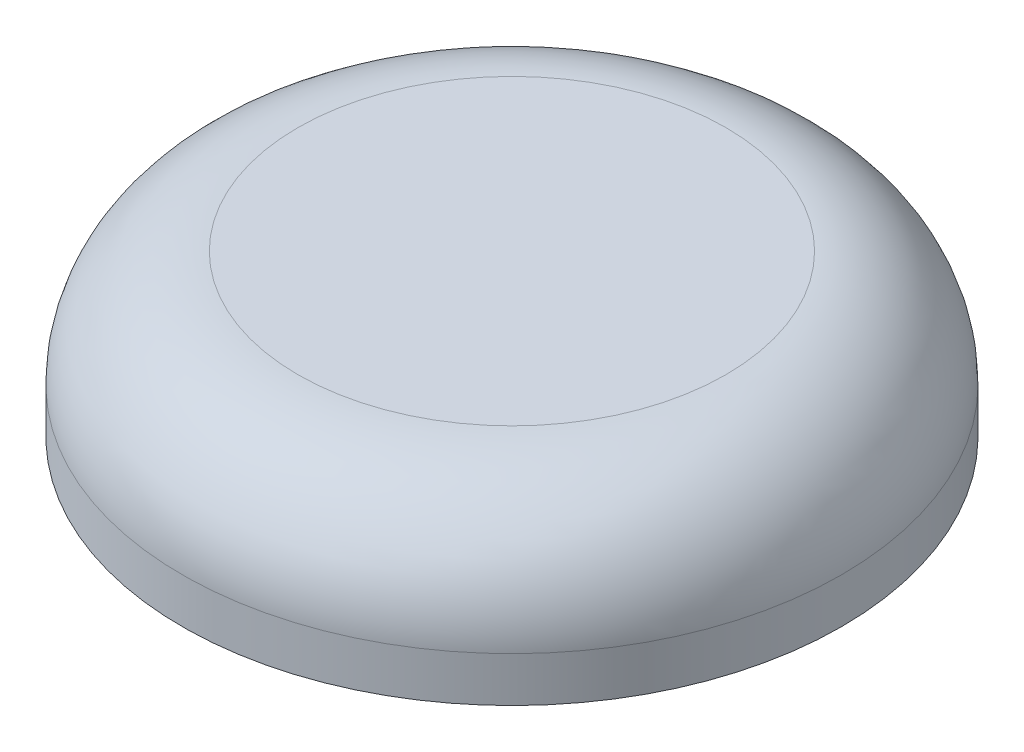
ISO-10303-21;
HEADER;
FILE_DESCRIPTION(('STEP AP214'),'2;1');
FILE_NAME('part.step','',(''),(''),'','','');
FILE_SCHEMA(('AUTOMOTIVE_DESIGN { 1 0 10303 214 1 1 1 1 }'));
ENDSEC;
DATA;
#1=APPLICATION_CONTEXT('core data for automotive mechanical design processes');
#2=APPLICATION_PROTOCOL_DEFINITION('international standard','automotive_design',2000,#1);
#3=PRODUCT_CONTEXT('',#1,'mechanical');
#4=PRODUCT('Part','Part','',(#3));
#5=PRODUCT_RELATED_PRODUCT_CATEGORY('part','',(#4));
#6=PRODUCT_DEFINITION_FORMATION('','',#4);
#7=PRODUCT_DEFINITION_CONTEXT('part definition',#1,'design');
#8=PRODUCT_DEFINITION('design','',#6,#7);
#9=PRODUCT_DEFINITION_SHAPE('','',#8);
#10=(LENGTH_UNIT() NAMED_UNIT(*) SI_UNIT(.MILLI.,.METRE.));
#11=(NAMED_UNIT(*) PLANE_ANGLE_UNIT() SI_UNIT($,.RADIAN.));
#12=(NAMED_UNIT(*) SI_UNIT($,.STERADIAN.) SOLID_ANGLE_UNIT());
#13=UNCERTAINTY_MEASURE_WITH_UNIT(LENGTH_MEASURE(1.E-05),#10,'distance_accuracy_value','');
#14=(GEOMETRIC_REPRESENTATION_CONTEXT(3) GLOBAL_UNCERTAINTY_ASSIGNED_CONTEXT((#13)) GLOBAL_UNIT_ASSIGNED_CONTEXT((#10,
#11,#12)) REPRESENTATION_CONTEXT('',''));
#15=CARTESIAN_POINT('',(0.,0.,0.));
#16=DIRECTION('',(0.,0.,1.));
#17=DIRECTION('',(1.,0.,0.));
#18=AXIS2_PLACEMENT_3D('',#15,#16,#17);
#19=CARTESIAN_POINT('',(0.,1.143,0.));
#20=DIRECTION('',(0.,-1.,0.));
#21=DIRECTION('',(1.,0.,0.));
#22=AXIS2_PLACEMENT_3D('',#19,#20,#21);
#23=PLANE('',#22);
#24=CARTESIAN_POINT('',(0.,1.143,0.));
#25=DIRECTION('',(0.,-1.,0.));
#26=DIRECTION('',(1.,0.,0.));
#27=AXIS2_PLACEMENT_3D('',#24,#25,#26);
#28=CIRCLE('',#27,12.7);
#29=CARTESIAN_POINT('',(12.7,1.143,0.));
#30=VERTEX_POINT('',#29);
#31=EDGE_CURVE('E54',#30,#30,#28,.T.);
#32=ORIENTED_EDGE('',*,*,#31,.F.);
#33=EDGE_LOOP('',(#32));
#34=FACE_BOUND('',#33,.T.);
#35=ADVANCED_FACE('F35',(#34),#23,.F.);
#36=CARTESIAN_POINT('',(0.,0.,0.));
#37=DIRECTION('',(0.,1.,0.));
#38=DIRECTION('',(-1.,0.,0.));
#39=AXIS2_PLACEMENT_3D('',#36,#37,#38);
#40=PLANE('',#39);
#41=CARTESIAN_POINT('',(0.,0.,0.));
#42=DIRECTION('',(0.,-1.,0.));
#43=DIRECTION('',(1.,0.,0.));
#44=AXIS2_PLACEMENT_3D('',#41,#42,#43);
#45=CIRCLE('',#44,12.065);
#46=CARTESIAN_POINT('',(12.065,0.,0.));
#47=VERTEX_POINT('',#46);
#48=EDGE_CURVE('E10',#47,#47,#45,.T.);
#49=ORIENTED_EDGE('',*,*,#48,.T.);
#50=EDGE_LOOP('',(#49));
#51=FACE_BOUND('',#50,.T.);
#52=ADVANCED_FACE('F61',(#51),#40,.F.);
#53=CARTESIAN_POINT('',(0.,0.,0.));
#54=DIRECTION('',(0.,-1.,0.));
#55=DIRECTION('',(1.,0.,0.));
#56=AXIS2_PLACEMENT_3D('',#53,#54,#55);
#57=CYLINDRICAL_SURFACE('',#56,12.065);
#58=ORIENTED_EDGE('',*,*,#48,.F.);
#59=EDGE_LOOP('',(#58));
#60=FACE_BOUND('',#59,.T.);
#61=CARTESIAN_POINT('',(0.,-8.382,0.));
#62=DIRECTION('',(0.,-1.,0.));
#63=DIRECTION('',(1.,0.,0.));
#64=AXIS2_PLACEMENT_3D('',#61,#62,#63);
#65=CIRCLE('',#64,12.065);
#66=CARTESIAN_POINT('',(12.065,-8.382,0.));
#67=VERTEX_POINT('',#66);
#68=EDGE_CURVE('E41',#67,#67,#65,.T.);
#69=ORIENTED_EDGE('',*,*,#68,.T.);
#70=EDGE_LOOP('',(#69));
#71=FACE_BOUND('',#70,.T.);
#72=ADVANCED_FACE('F65',(#60,#71),#57,.F.);
#73=CARTESIAN_POINT('',(-12.065,-8.382,0.));
#74=DIRECTION('',(0.,1.,0.));
#75=DIRECTION('',(-1.,0.,0.));
#76=AXIS2_PLACEMENT_3D('',#73,#74,#75);
#77=PLANE('',#76);
#78=ORIENTED_EDGE('',*,*,#68,.F.);
#79=EDGE_LOOP('',(#78));
#80=FACE_BOUND('',#79,.T.);
#81=CARTESIAN_POINT('',(0.,-8.382,0.));
#82=DIRECTION('',(0.,-1.,0.));
#83=DIRECTION('',(1.,0.,0.));
#84=AXIS2_PLACEMENT_3D('',#81,#82,#83);
#85=CIRCLE('',#84,19.558);
#86=CARTESIAN_POINT('',(19.558,-8.382,0.));
#87=VERTEX_POINT('',#86);
#88=EDGE_CURVE('E45',#87,#87,#85,.T.);
#89=ORIENTED_EDGE('',*,*,#88,.T.);
#90=EDGE_LOOP('',(#89));
#91=FACE_BOUND('',#90,.T.);
#92=ADVANCED_FACE('F69',(#80,#91),#77,.F.);
#93=CARTESIAN_POINT('',(0.,0.,0.));
#94=DIRECTION('',(0.,-1.,0.));
#95=DIRECTION('',(1.,0.,0.));
#96=AXIS2_PLACEMENT_3D('',#93,#94,#95);
#97=CYLINDRICAL_SURFACE('',#96,19.558);
#98=ORIENTED_EDGE('',*,*,#88,.F.);
#99=EDGE_LOOP('',(#98));
#100=FACE_BOUND('',#99,.T.);
#101=CARTESIAN_POINT('',(0.,-5.715,0.));
#102=DIRECTION('',(0.,-1.,0.));
#103=DIRECTION('',(1.,0.,0.));
#104=AXIS2_PLACEMENT_3D('',#101,#102,#103);
#105=CIRCLE('',#104,19.558);
#106=CARTESIAN_POINT('',(19.558,-5.715,0.));
#107=VERTEX_POINT('',#106);
#108=EDGE_CURVE('E49',#107,#107,#105,.T.);
#109=ORIENTED_EDGE('',*,*,#108,.T.);
#110=EDGE_LOOP('',(#109));
#111=FACE_BOUND('',#110,.T.);
#112=ADVANCED_FACE('F75',(#100,#111),#97,.T.);
#113=CARTESIAN_POINT('',(0.,-5.715,0.));
#114=DIRECTION('',(0.,-1.,0.));
#115=DIRECTION('',(1.,0.,0.));
#116=AXIS2_PLACEMENT_3D('',#113,#114,#115);
#117=TOROIDAL_SURFACE('',#116,12.7,6.858);
#118=ORIENTED_EDGE('',*,*,#108,.F.);
#119=EDGE_LOOP('',(#118));
#120=FACE_BOUND('',#119,.T.);
#121=ORIENTED_EDGE('',*,*,#31,.T.);
#122=EDGE_LOOP('',(#121));
#123=FACE_BOUND('',#122,.T.);
#124=ADVANCED_FACE('F58',(#120,#123),#117,.T.);
#125=CLOSED_SHELL('',(#35,#52,#72,#92,#112,#124));
#126=MANIFOLD_SOLID_BREP('B2',#125);
#127=ADVANCED_BREP_SHAPE_REPRESENTATION('',(#18,#126),#14);
#128=SHAPE_DEFINITION_REPRESENTATION(#9,#127);
ENDSEC;
END-ISO-10303-21;
